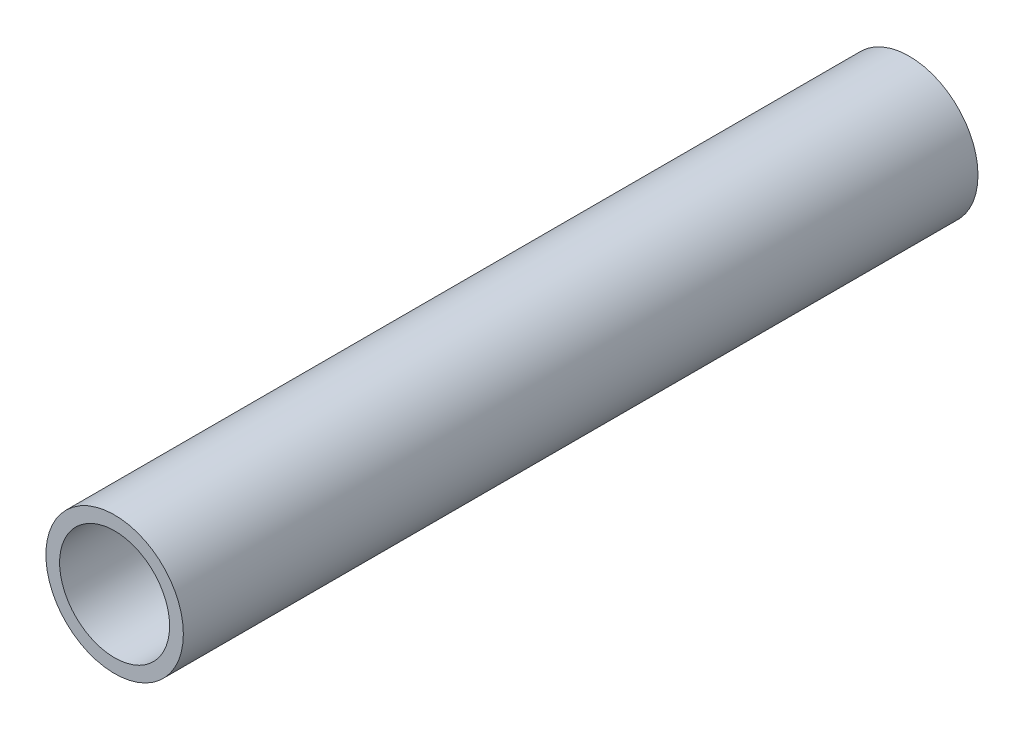
ISO-10303-21;
HEADER;
FILE_DESCRIPTION(('STEP AP214'),'2;1');
FILE_NAME('part.step','',(''),(''),'','','');
FILE_SCHEMA(('AUTOMOTIVE_DESIGN { 1 0 10303 214 1 1 1 1 }'));
ENDSEC;
DATA;
#1=APPLICATION_CONTEXT('core data for automotive mechanical design processes');
#2=APPLICATION_PROTOCOL_DEFINITION('international standard','automotive_design',2000,#1);
#3=PRODUCT_CONTEXT('',#1,'mechanical');
#4=PRODUCT('Part','Part','',(#3));
#5=PRODUCT_RELATED_PRODUCT_CATEGORY('part','',(#4));
#6=PRODUCT_DEFINITION_FORMATION('','',#4);
#7=PRODUCT_DEFINITION_CONTEXT('part definition',#1,'design');
#8=PRODUCT_DEFINITION('design','',#6,#7);
#9=PRODUCT_DEFINITION_SHAPE('','',#8);
#10=(LENGTH_UNIT() NAMED_UNIT(*) SI_UNIT(.MILLI.,.METRE.));
#11=(NAMED_UNIT(*) PLANE_ANGLE_UNIT() SI_UNIT($,.RADIAN.));
#12=(NAMED_UNIT(*) SI_UNIT($,.STERADIAN.) SOLID_ANGLE_UNIT());
#13=UNCERTAINTY_MEASURE_WITH_UNIT(LENGTH_MEASURE(1.E-05),#10,'distance_accuracy_value','');
#14=(GEOMETRIC_REPRESENTATION_CONTEXT(3) GLOBAL_UNCERTAINTY_ASSIGNED_CONTEXT((#13)) GLOBAL_UNIT_ASSIGNED_CONTEXT((#10,
#11,#12)) REPRESENTATION_CONTEXT('',''));
#15=CARTESIAN_POINT('',(0.,0.,0.));
#16=DIRECTION('',(0.,0.,1.));
#17=DIRECTION('',(1.,0.,0.));
#18=AXIS2_PLACEMENT_3D('',#15,#16,#17);
#19=CARTESIAN_POINT('',(0.,0.,14.45));
#20=DIRECTION('',(0.,0.,1.));
#21=DIRECTION('',(1.,0.,0.));
#22=AXIS2_PLACEMENT_3D('',#19,#20,#21);
#23=PLANE('',#22);
#24=CARTESIAN_POINT('',(0.,0.,14.45));
#25=DIRECTION('',(0.,0.,1.));
#26=DIRECTION('',(1.,0.,0.));
#27=AXIS2_PLACEMENT_3D('',#24,#25,#26);
#28=CIRCLE('',#27,1.25);
#29=CARTESIAN_POINT('',(1.25,0.,14.45));
#30=VERTEX_POINT('',#29);
#31=EDGE_CURVE('E10',#30,#30,#28,.T.);
#32=ORIENTED_EDGE('',*,*,#31,.T.);
#33=EDGE_LOOP('',(#32));
#34=FACE_BOUND('',#33,.T.);
#35=CARTESIAN_POINT('',(0.,0.,14.45));
#36=DIRECTION('',(0.,0.,1.));
#37=DIRECTION('',(1.,0.,0.));
#38=AXIS2_PLACEMENT_3D('',#35,#36,#37);
#39=CIRCLE('',#38,1.);
#40=CARTESIAN_POINT('',(1.,0.,14.45));
#41=VERTEX_POINT('',#40);
#42=EDGE_CURVE('E42',#41,#41,#39,.T.);
#43=ORIENTED_EDGE('',*,*,#42,.F.);
#44=EDGE_LOOP('',(#43));
#45=FACE_BOUND('',#44,.T.);
#46=ADVANCED_FACE('F31',(#34,#45),#23,.T.);
#47=CARTESIAN_POINT('',(0.,0.,0.));
#48=DIRECTION('',(0.,0.,1.));
#49=DIRECTION('',(1.,0.,0.));
#50=AXIS2_PLACEMENT_3D('',#47,#48,#49);
#51=PLANE('',#50);
#52=CARTESIAN_POINT('',(0.,0.,0.));
#53=DIRECTION('',(0.,0.,1.));
#54=DIRECTION('',(1.,0.,0.));
#55=AXIS2_PLACEMENT_3D('',#52,#53,#54);
#56=CIRCLE('',#55,1.25);
#57=CARTESIAN_POINT('',(1.25,0.,0.));
#58=VERTEX_POINT('',#57);
#59=EDGE_CURVE('E35',#58,#58,#56,.T.);
#60=ORIENTED_EDGE('',*,*,#59,.F.);
#61=EDGE_LOOP('',(#60));
#62=FACE_BOUND('',#61,.T.);
#63=CARTESIAN_POINT('',(0.,0.,0.));
#64=DIRECTION('',(0.,0.,1.));
#65=DIRECTION('',(1.,0.,0.));
#66=AXIS2_PLACEMENT_3D('',#63,#64,#65);
#67=CIRCLE('',#66,1.);
#68=CARTESIAN_POINT('',(1.,0.,0.));
#69=VERTEX_POINT('',#68);
#70=EDGE_CURVE('E44',#69,#69,#67,.T.);
#71=ORIENTED_EDGE('',*,*,#70,.T.);
#72=EDGE_LOOP('',(#71));
#73=FACE_BOUND('',#72,.T.);
#74=ADVANCED_FACE('F54',(#62,#73),#51,.F.);
#75=CARTESIAN_POINT('',(0.,0.,14.45));
#76=DIRECTION('',(0.,0.,-1.));
#77=DIRECTION('',(-1.,0.,0.));
#78=AXIS2_PLACEMENT_3D('',#75,#76,#77);
#79=CYLINDRICAL_SURFACE('',#78,1.25);
#80=ORIENTED_EDGE('',*,*,#31,.F.);
#81=EDGE_LOOP('',(#80));
#82=FACE_BOUND('',#81,.T.);
#83=ORIENTED_EDGE('',*,*,#59,.T.);
#84=EDGE_LOOP('',(#83));
#85=FACE_BOUND('',#84,.T.);
#86=ADVANCED_FACE('F33',(#82,#85),#79,.T.);
#87=CARTESIAN_POINT('',(0.,0.,14.45));
#88=DIRECTION('',(0.,0.,-1.));
#89=DIRECTION('',(-1.,0.,0.));
#90=AXIS2_PLACEMENT_3D('',#87,#88,#89);
#91=CYLINDRICAL_SURFACE('',#90,1.);
#92=ORIENTED_EDGE('',*,*,#42,.T.);
#93=EDGE_LOOP('',(#92));
#94=FACE_BOUND('',#93,.T.);
#95=ORIENTED_EDGE('',*,*,#70,.F.);
#96=EDGE_LOOP('',(#95));
#97=FACE_BOUND('',#96,.T.);
#98=ADVANCED_FACE('F50',(#94,#97),#91,.F.);
#99=CLOSED_SHELL('',(#46,#74,#86,#98));
#100=MANIFOLD_SOLID_BREP('B2',#99);
#101=ADVANCED_BREP_SHAPE_REPRESENTATION('',(#18,#100),#14);
#102=SHAPE_DEFINITION_REPRESENTATION(#9,#101);
ENDSEC;
END-ISO-10303-21;
